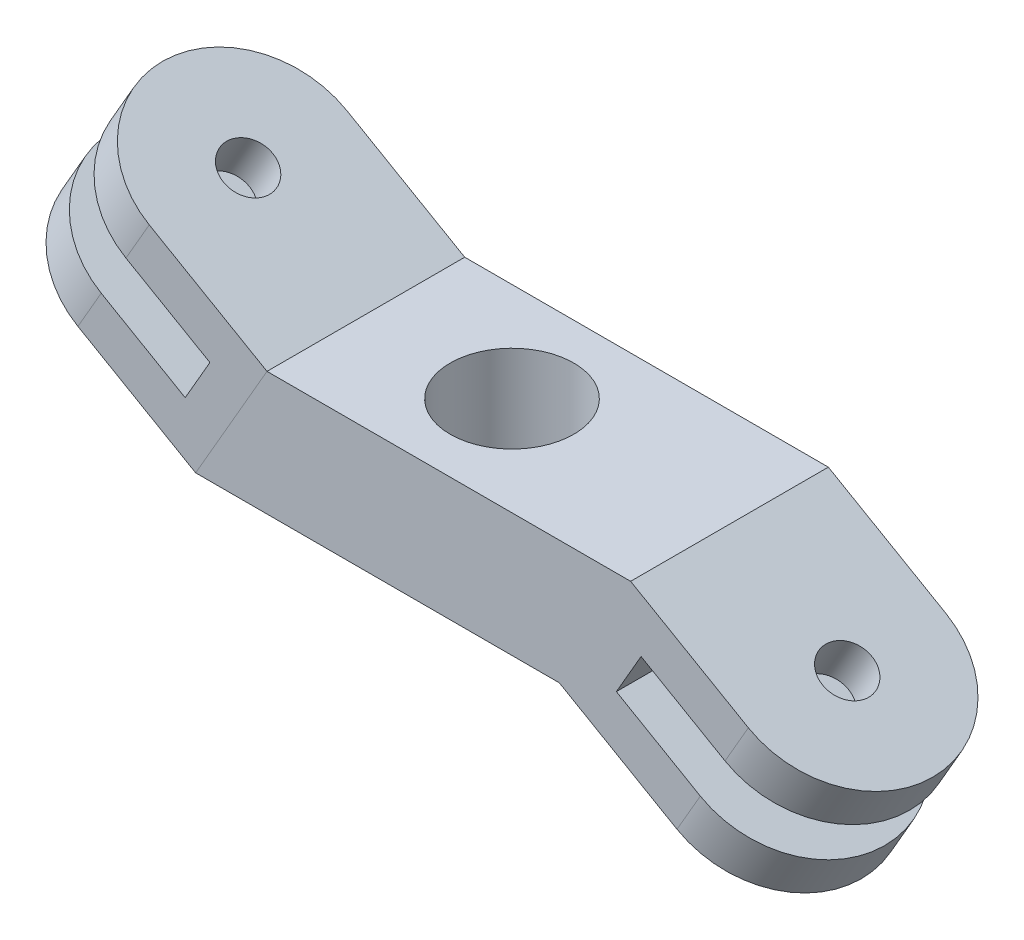
ISO-10303-21;
HEADER;
FILE_DESCRIPTION(('STEP AP214'),'2;1');
FILE_NAME('part.step','',(''),(''),'','','');
FILE_SCHEMA(('AUTOMOTIVE_DESIGN { 1 0 10303 214 1 1 1 1 }'));
ENDSEC;
DATA;
#1=APPLICATION_CONTEXT('core data for automotive mechanical design processes');
#2=APPLICATION_PROTOCOL_DEFINITION('international standard','automotive_design',2000,#1);
#3=PRODUCT_CONTEXT('',#1,'mechanical');
#4=PRODUCT('Part','Part','',(#3));
#5=PRODUCT_RELATED_PRODUCT_CATEGORY('part','',(#4));
#6=PRODUCT_DEFINITION_FORMATION('','',#4);
#7=PRODUCT_DEFINITION_CONTEXT('part definition',#1,'design');
#8=PRODUCT_DEFINITION('design','',#6,#7);
#9=PRODUCT_DEFINITION_SHAPE('','',#8);
#10=(LENGTH_UNIT() NAMED_UNIT(*) SI_UNIT(.MILLI.,.METRE.));
#11=(NAMED_UNIT(*) PLANE_ANGLE_UNIT() SI_UNIT($,.RADIAN.));
#12=(NAMED_UNIT(*) SI_UNIT($,.STERADIAN.) SOLID_ANGLE_UNIT());
#13=UNCERTAINTY_MEASURE_WITH_UNIT(LENGTH_MEASURE(1.E-05),#10,'distance_accuracy_value','');
#14=(GEOMETRIC_REPRESENTATION_CONTEXT(3) GLOBAL_UNCERTAINTY_ASSIGNED_CONTEXT((#13)) GLOBAL_UNIT_ASSIGNED_CONTEXT((#10,
#11,#12)) REPRESENTATION_CONTEXT('',''));
#15=CARTESIAN_POINT('',(0.,0.,0.));
#16=DIRECTION('',(0.,0.,1.));
#17=DIRECTION('',(1.,0.,0.));
#18=AXIS2_PLACEMENT_3D('',#15,#16,#17);
#19=CARTESIAN_POINT('',(-13.5634569427296,2.75040954163251,0.));
#20=DIRECTION('',(0.499999999999998,0.86602540378444,0.));
#21=DIRECTION('',(-0.86602540378444,0.499999999999998,0.));
#22=AXIS2_PLACEMENT_3D('',#19,#20,#21);
#23=CYLINDRICAL_SURFACE('',#22,4.);
#24=DIRECTION('',(0.499999999999998,0.86602540378444,0.));
#25=VECTOR('',#24,1.);
#26=CARTESIAN_POINT('',(-13.5634569427296,2.75040954163251,-4.));
#27=LINE('',#26,#25);
#28=CARTESIAN_POINT('',(-11.6200812697556,6.11643494541695,-4.));
#29=VERTEX_POINT('',#28);
#30=CARTESIAN_POINT('',(-10.6767055967815,7.75040954163251,-4.));
#31=VERTEX_POINT('',#30);
#32=EDGE_CURVE('E88',#29,#31,#27,.T.);
#33=ORIENTED_EDGE('',*,*,#32,.F.);
#34=CARTESIAN_POINT('',(-11.6200812697556,6.11643494541695,0.));
#35=DIRECTION('',(-0.499999999999998,-0.86602540378444,0.));
#36=DIRECTION('',(0.86602540378444,-0.499999999999998,0.));
#37=AXIS2_PLACEMENT_3D('',#34,#35,#36);
#38=CIRCLE('',#37,4.);
#39=CARTESIAN_POINT('',(-11.6200812697556,6.11643494541695,4.));
#40=VERTEX_POINT('',#39);
#41=EDGE_CURVE('E141',#29,#40,#38,.F.);
#42=ORIENTED_EDGE('',*,*,#41,.T.);
#43=DIRECTION('',(0.499999999999998,0.86602540378444,0.));
#44=VECTOR('',#43,1.);
#45=CARTESIAN_POINT('',(-13.5634569427296,2.75040954163251,4.));
#46=LINE('',#45,#44);
#47=CARTESIAN_POINT('',(-10.6767055967815,7.75040954163251,4.));
#48=VERTEX_POINT('',#47);
#49=EDGE_CURVE('E138',#40,#48,#46,.T.);
#50=ORIENTED_EDGE('',*,*,#49,.T.);
#51=CARTESIAN_POINT('',(-10.6767055967815,7.75040954163251,0.));
#52=DIRECTION('',(0.499999999999998,0.86602540378444,0.));
#53=DIRECTION('',(0.86602540378444,-0.499999999999998,0.));
#54=AXIS2_PLACEMENT_3D('',#51,#52,#53);
#55=CIRCLE('',#54,4.);
#56=EDGE_CURVE('E159',#31,#48,#55,.T.);
#57=ORIENTED_EDGE('',*,*,#56,.F.);
#58=EDGE_LOOP('',(#33,#42,#50,#57));
#59=FACE_BOUND('',#58,.T.);
#60=ADVANCED_FACE('F43',(#59),#23,.T.);
#61=CARTESIAN_POINT('',(-13.5634569427296,2.75040954163251,-4.));
#62=DIRECTION('',(0.,0.,-1.));
#63=DIRECTION('',(-1.,0.,0.));
#64=AXIS2_PLACEMENT_3D('',#61,#62,#63);
#65=PLANE('',#64);
#66=DIRECTION('',(0.499999999999998,0.86602540378444,0.));
#67=VECTOR('',#66,1.);
#68=CARTESIAN_POINT('',(-10.1661349398034,0.788964768719224,-4.));
#69=LINE('',#68,#67);
#70=CARTESIAN_POINT('',(-9.22275926682937,2.42293936493478,-4.));
#71=VERTEX_POINT('',#70);
#72=CARTESIAN_POINT('',(-8.22275926682937,4.15499017250366,-4.));
#73=VERTEX_POINT('',#72);
#74=EDGE_CURVE('E130',#71,#73,#69,.T.);
#75=ORIENTED_EDGE('',*,*,#74,.T.);
#76=DIRECTION('',(-0.86602540378444,0.499999999999998,0.));
#77=VECTOR('',#76,1.);
#78=CARTESIAN_POINT('',(-11.6200812697556,6.11643494541695,-4.));
#79=LINE('',#78,#77);
#80=EDGE_CURVE('E144',#73,#29,#79,.T.);
#81=ORIENTED_EDGE('',*,*,#80,.T.);
#82=ORIENTED_EDGE('',*,*,#32,.T.);
#83=DIRECTION('',(-0.86602540378444,0.499999999999998,0.));
#84=VECTOR('',#83,1.);
#85=CARTESIAN_POINT('',(-10.6767055967815,7.75040954163251,-4.));
#86=LINE('',#85,#84);
#87=CARTESIAN_POINT('',(-5.91285652905178,5.,-4.));
#88=VERTEX_POINT('',#87);
#89=EDGE_CURVE('E163',#88,#31,#86,.T.);
#90=ORIENTED_EDGE('',*,*,#89,.F.);
#91=DIRECTION('',(0.499999999999998,0.86602540378444,0.));
#92=VECTOR('',#91,1.);
#93=CARTESIAN_POINT('',(-8.79960787499989,0.,-4.));
#94=LINE('',#93,#92);
#95=CARTESIAN_POINT('',(-8.79960787499989,0.,-4.));
#96=VERTEX_POINT('',#95);
#97=EDGE_CURVE('E182',#96,#88,#94,.T.);
#98=ORIENTED_EDGE('',*,*,#97,.F.);
#99=DIRECTION('',(-0.86602540378444,0.499999999999998,0.));
#100=VECTOR('',#99,1.);
#101=CARTESIAN_POINT('',(-13.5634569427296,2.75040954163251,-4.));
#102=LINE('',#101,#100);
#103=CARTESIAN_POINT('',(-13.5634569427296,2.75040954163251,-4.));
#104=VERTEX_POINT('',#103);
#105=EDGE_CURVE('E168',#96,#104,#102,.T.);
#106=ORIENTED_EDGE('',*,*,#105,.T.);
#107=CARTESIAN_POINT('',(-12.6200812697556,4.38438413784807,-4.));
#108=VERTEX_POINT('',#107);
#109=EDGE_CURVE('E51',#104,#108,#27,.T.);
#110=ORIENTED_EDGE('',*,*,#109,.T.);
#111=DIRECTION('',(-0.86602540378444,0.499999999999998,0.));
#112=VECTOR('',#111,1.);
#113=CARTESIAN_POINT('',(-12.6200812697556,4.38438413784807,-4.));
#114=LINE('',#113,#112);
#115=EDGE_CURVE('E147',#71,#108,#114,.T.);
#116=ORIENTED_EDGE('',*,*,#115,.F.);
#117=EDGE_LOOP('',(#75,#81,#82,#90,#98,#106,#110,#116));
#118=FACE_BOUND('',#117,.T.);
#119=ADVANCED_FACE('F191',(#118),#65,.T.);
#120=CARTESIAN_POINT('',(-13.5634569427296,2.75040954163251,4.));
#121=DIRECTION('',(0.,0.,1.));
#122=DIRECTION('',(1.,0.,0.));
#123=AXIS2_PLACEMENT_3D('',#120,#121,#122);
#124=PLANE('',#123);
#125=ORIENTED_EDGE('',*,*,#49,.F.);
#126=DIRECTION('',(0.86602540378444,-0.499999999999998,0.));
#127=VECTOR('',#126,1.);
#128=CARTESIAN_POINT('',(-11.6200812697556,6.11643494541695,4.));
#129=LINE('',#128,#127);
#130=CARTESIAN_POINT('',(-8.22275926682937,4.15499017250366,4.));
#131=VERTEX_POINT('',#130);
#132=EDGE_CURVE('E136',#40,#131,#129,.T.);
#133=ORIENTED_EDGE('',*,*,#132,.T.);
#134=DIRECTION('',(-0.499999999999998,-0.86602540378444,0.));
#135=VECTOR('',#134,1.);
#136=CARTESIAN_POINT('',(-10.1661349398034,0.788964768719224,4.));
#137=LINE('',#136,#135);
#138=CARTESIAN_POINT('',(-9.22275926682937,2.42293936493478,4.));
#139=VERTEX_POINT('',#138);
#140=EDGE_CURVE('E12',#131,#139,#137,.T.);
#141=ORIENTED_EDGE('',*,*,#140,.T.);
#142=DIRECTION('',(0.86602540378444,-0.499999999999998,0.));
#143=VECTOR('',#142,1.);
#144=CARTESIAN_POINT('',(-12.6200812697556,4.38438413784807,4.));
#145=LINE('',#144,#143);
#146=CARTESIAN_POINT('',(-12.6200812697556,4.38438413784807,4.));
#147=VERTEX_POINT('',#146);
#148=EDGE_CURVE('E117',#147,#139,#145,.T.);
#149=ORIENTED_EDGE('',*,*,#148,.F.);
#150=CARTESIAN_POINT('',(-13.5634569427296,2.75040954163251,4.));
#151=VERTEX_POINT('',#150);
#152=EDGE_CURVE('E95',#151,#147,#46,.T.);
#153=ORIENTED_EDGE('',*,*,#152,.F.);
#154=DIRECTION('',(0.86602540378444,-0.499999999999998,0.));
#155=VECTOR('',#154,1.);
#156=CARTESIAN_POINT('',(-13.5634569427296,2.75040954163251,4.));
#157=LINE('',#156,#155);
#158=CARTESIAN_POINT('',(-8.79960787499989,0.,4.));
#159=VERTEX_POINT('',#158);
#160=EDGE_CURVE('E162',#151,#159,#157,.T.);
#161=ORIENTED_EDGE('',*,*,#160,.T.);
#162=DIRECTION('',(0.499999999999998,0.86602540378444,0.));
#163=VECTOR('',#162,1.);
#164=CARTESIAN_POINT('',(-8.79960787499989,0.,4.));
#165=LINE('',#164,#163);
#166=CARTESIAN_POINT('',(-5.91285652905178,5.,4.));
#167=VERTEX_POINT('',#166);
#168=EDGE_CURVE('E184',#159,#167,#165,.T.);
#169=ORIENTED_EDGE('',*,*,#168,.T.);
#170=DIRECTION('',(0.86602540378444,-0.499999999999998,0.));
#171=VECTOR('',#170,1.);
#172=CARTESIAN_POINT('',(-10.6767055967815,7.75040954163251,4.));
#173=LINE('',#172,#171);
#174=EDGE_CURVE('E173',#48,#167,#173,.T.);
#175=ORIENTED_EDGE('',*,*,#174,.F.);
#176=EDGE_LOOP('',(#125,#133,#141,#149,#153,#161,#169,#175));
#177=FACE_BOUND('',#176,.T.);
#178=ADVANCED_FACE('F135',(#177),#124,.T.);
#179=CARTESIAN_POINT('',(-14.9776705051027,0.300919798849321,0.));
#180=DIRECTION('',(0.499999999999998,0.86602540378444,0.));
#181=DIRECTION('',(-0.86602540378444,0.499999999999998,0.));
#182=AXIS2_PLACEMENT_3D('',#179,#180,#181);
#183=CYLINDRICAL_SURFACE('',#182,1.);
#184=CARTESIAN_POINT('',(-10.6767055967815,7.75040954163251,0.));
#185=DIRECTION('',(0.499999999999998,0.86602540378444,0.));
#186=DIRECTION('',(-0.86602540378444,0.499999999999998,0.));
#187=AXIS2_PLACEMENT_3D('',#184,#185,#186);
#188=CIRCLE('',#187,1.);
#189=CARTESIAN_POINT('',(-11.542731000566,8.25040954163251,0.));
#190=VERTEX_POINT('',#189);
#191=EDGE_CURVE('E153',#190,#190,#188,.T.);
#192=ORIENTED_EDGE('',*,*,#191,.T.);
#193=EDGE_LOOP('',(#192));
#194=FACE_BOUND('',#193,.T.);
#195=CARTESIAN_POINT('',(-11.6200812697556,6.11643494541695,0.));
#196=DIRECTION('',(-0.499999999999998,-0.86602540378444,0.));
#197=DIRECTION('',(0.86602540378444,-0.499999999999998,0.));
#198=AXIS2_PLACEMENT_3D('',#195,#196,#197);
#199=CIRCLE('',#198,1.);
#200=CARTESIAN_POINT('',(-10.7540558659712,5.61643494541695,0.));
#201=VERTEX_POINT('',#200);
#202=EDGE_CURVE('E142',#201,#201,#199,.F.);
#203=ORIENTED_EDGE('',*,*,#202,.F.);
#204=EDGE_LOOP('',(#203));
#205=FACE_BOUND('',#204,.T.);
#206=ADVANCED_FACE('F209',(#194,#205),#183,.F.);
#207=CARTESIAN_POINT('',(-12.6200812697556,4.38438413784807,0.));
#208=DIRECTION('',(-0.499999999999998,-0.86602540378444,0.));
#209=DIRECTION('',(0.86602540378444,-0.499999999999998,0.));
#210=AXIS2_PLACEMENT_3D('',#207,#208,#209);
#211=CIRCLE('',#210,4.);
#212=EDGE_CURVE('E58',#108,#147,#211,.F.);
#213=ORIENTED_EDGE('',*,*,#212,.F.);
#214=ORIENTED_EDGE('',*,*,#109,.F.);
#215=CARTESIAN_POINT('',(-13.5634569427296,2.75040954163251,0.));
#216=DIRECTION('',(0.499999999999998,0.86602540378444,0.));
#217=DIRECTION('',(0.86602540378444,-0.499999999999998,0.));
#218=AXIS2_PLACEMENT_3D('',#215,#216,#217);
#219=CIRCLE('',#218,4.);
#220=EDGE_CURVE('E160',#104,#151,#219,.T.);
#221=ORIENTED_EDGE('',*,*,#220,.T.);
#222=ORIENTED_EDGE('',*,*,#152,.T.);
#223=EDGE_LOOP('',(#213,#214,#221,#222));
#224=FACE_BOUND('',#223,.T.);
#225=ADVANCED_FACE('F45',(#224),#23,.T.);
#226=CARTESIAN_POINT('',(-8.79960787499989,0.,4.));
#227=DIRECTION('',(0.86602540378444,-0.499999999999998,0.));
#228=DIRECTION('',(0.499999999999998,0.86602540378444,0.));
#229=AXIS2_PLACEMENT_3D('',#226,#227,#228);
#230=PLANE('',#229);
#231=DIRECTION('',(0.,0.,-1.));
#232=VECTOR('',#231,1.);
#233=CARTESIAN_POINT('',(-5.91285652905178,5.,4.));
#234=LINE('',#233,#232);
#235=EDGE_CURVE('E176',#167,#88,#234,.T.);
#236=ORIENTED_EDGE('',*,*,#235,.F.);
#237=ORIENTED_EDGE('',*,*,#168,.F.);
#238=DIRECTION('',(0.,0.,-1.));
#239=VECTOR('',#238,1.);
#240=CARTESIAN_POINT('',(-8.79960787499989,0.,4.));
#241=LINE('',#240,#239);
#242=EDGE_CURVE('E165',#159,#96,#241,.T.);
#243=ORIENTED_EDGE('',*,*,#242,.T.);
#244=ORIENTED_EDGE('',*,*,#97,.T.);
#245=EDGE_LOOP('',(#236,#237,#243,#244));
#246=FACE_BOUND('',#245,.T.);
#247=ADVANCED_FACE('F198',(#246),#230,.T.);
#248=CARTESIAN_POINT('',(-13.5634569427296,2.75040954163251,0.));
#249=DIRECTION('',(-0.499999999999998,-0.86602540378444,0.));
#250=DIRECTION('',(0.86602540378444,-0.499999999999998,0.));
#251=AXIS2_PLACEMENT_3D('',#248,#249,#250);
#252=PLANE('',#251);
#253=CARTESIAN_POINT('',(-13.5634569427296,2.75040954163251,0.));
#254=DIRECTION('',(-0.499999999999998,-0.86602540378444,0.));
#255=DIRECTION('',(0.86602540378444,-0.499999999999998,0.));
#256=AXIS2_PLACEMENT_3D('',#253,#254,#255);
#257=CIRCLE('',#256,1.);
#258=CARTESIAN_POINT('',(-12.6974315389452,2.25040954163251,0.));
#259=VERTEX_POINT('',#258);
#260=EDGE_CURVE('E156',#259,#259,#257,.F.);
#261=ORIENTED_EDGE('',*,*,#260,.T.);
#262=EDGE_LOOP('',(#261));
#263=FACE_BOUND('',#262,.T.);
#264=ORIENTED_EDGE('',*,*,#220,.F.);
#265=ORIENTED_EDGE('',*,*,#105,.F.);
#266=ORIENTED_EDGE('',*,*,#242,.F.);
#267=ORIENTED_EDGE('',*,*,#160,.F.);
#268=EDGE_LOOP('',(#264,#265,#266,#267));
#269=FACE_BOUND('',#268,.T.);
#270=ADVANCED_FACE('F195',(#263,#269),#252,.T.);
#271=CARTESIAN_POINT('',(-10.6767055967815,7.75040954163251,0.));
#272=DIRECTION('',(-0.499999999999998,-0.86602540378444,0.));
#273=DIRECTION('',(0.86602540378444,-0.499999999999998,0.));
#274=AXIS2_PLACEMENT_3D('',#271,#272,#273);
#275=PLANE('',#274);
#276=ORIENTED_EDGE('',*,*,#191,.F.);
#277=EDGE_LOOP('',(#276));
#278=FACE_BOUND('',#277,.T.);
#279=ORIENTED_EDGE('',*,*,#56,.T.);
#280=ORIENTED_EDGE('',*,*,#174,.T.);
#281=ORIENTED_EDGE('',*,*,#235,.T.);
#282=ORIENTED_EDGE('',*,*,#89,.T.);
#283=EDGE_LOOP('',(#279,#280,#281,#282));
#284=FACE_BOUND('',#283,.T.);
#285=ADVANCED_FACE('F200',(#278,#284),#275,.F.);
#286=CARTESIAN_POINT('',(-12.6200812697556,4.38438413784807,0.));
#287=DIRECTION('',(-0.499999999999998,-0.86602540378444,0.));
#288=DIRECTION('',(0.86602540378444,-0.499999999999998,0.));
#289=AXIS2_PLACEMENT_3D('',#286,#287,#288);
#290=CIRCLE('',#289,1.);
#291=CARTESIAN_POINT('',(-11.7540558659711,3.88438413784807,0.));
#292=VERTEX_POINT('',#291);
#293=EDGE_CURVE('E123',#292,#292,#290,.F.);
#294=ORIENTED_EDGE('',*,*,#293,.T.);
#295=EDGE_LOOP('',(#294));
#296=FACE_BOUND('',#295,.T.);
#297=ORIENTED_EDGE('',*,*,#260,.F.);
#298=EDGE_LOOP('',(#297));
#299=FACE_BOUND('',#298,.T.);
#300=ADVANCED_FACE('F205',(#296,#299),#183,.F.);
#301=CARTESIAN_POINT('',(-0.256526295775901,-0.444316577761305,0.));
#302=DIRECTION('',(-0.499999999999998,-0.86602540378444,0.));
#303=DIRECTION('',(0.86602540378444,-0.499999999999998,0.));
#304=AXIS2_PLACEMENT_3D('',#301,#302,#303);
#305=PLANE('',#304);
#306=DIRECTION('',(0.,0.,-1.));
#307=VECTOR('',#306,1.);
#308=CARTESIAN_POINT('',(-8.22275926682937,4.15499017250366,-8.29704242386596));
#309=LINE('',#308,#307);
#310=EDGE_CURVE('E131',#131,#73,#309,.T.);
#311=ORIENTED_EDGE('',*,*,#310,.F.);
#312=ORIENTED_EDGE('',*,*,#132,.F.);
#313=ORIENTED_EDGE('',*,*,#41,.F.);
#314=ORIENTED_EDGE('',*,*,#80,.F.);
#315=EDGE_LOOP('',(#311,#312,#313,#314));
#316=FACE_BOUND('',#315,.T.);
#317=ORIENTED_EDGE('',*,*,#202,.T.);
#318=EDGE_LOOP('',(#317));
#319=FACE_BOUND('',#318,.T.);
#320=ADVANCED_FACE('F202',(#316,#319),#305,.T.);
#321=CARTESIAN_POINT('',(-1.2565262957759,-2.17636738533018,0.));
#322=DIRECTION('',(-0.499999999999998,-0.86602540378444,0.));
#323=DIRECTION('',(0.86602540378444,-0.499999999999998,0.));
#324=AXIS2_PLACEMENT_3D('',#321,#322,#323);
#325=PLANE('',#324);
#326=ORIENTED_EDGE('',*,*,#115,.T.);
#327=ORIENTED_EDGE('',*,*,#212,.T.);
#328=ORIENTED_EDGE('',*,*,#148,.T.);
#329=DIRECTION('',(0.,0.,-1.));
#330=VECTOR('',#329,1.);
#331=CARTESIAN_POINT('',(-9.22275926682937,2.42293936493478,-8.29704242386596));
#332=LINE('',#331,#330);
#333=EDGE_CURVE('E121',#139,#71,#332,.T.);
#334=ORIENTED_EDGE('',*,*,#333,.T.);
#335=EDGE_LOOP('',(#326,#327,#328,#334));
#336=FACE_BOUND('',#335,.T.);
#337=ORIENTED_EDGE('',*,*,#293,.F.);
#338=EDGE_LOOP('',(#337));
#339=FACE_BOUND('',#338,.T.);
#340=ADVANCED_FACE('F119',(#336,#339),#325,.F.);
#341=CARTESIAN_POINT('',(-8.22275926682937,4.15499017250366,-8.29704242386596));
#342=DIRECTION('',(-0.86602540378444,0.499999999999998,0.));
#343=DIRECTION('',(-0.499999999999998,-0.86602540378444,0.));
#344=AXIS2_PLACEMENT_3D('',#341,#342,#343);
#345=PLANE('',#344);
#346=ORIENTED_EDGE('',*,*,#333,.F.);
#347=ORIENTED_EDGE('',*,*,#140,.F.);
#348=ORIENTED_EDGE('',*,*,#310,.T.);
#349=ORIENTED_EDGE('',*,*,#74,.F.);
#350=EDGE_LOOP('',(#346,#347,#348,#349));
#351=FACE_BOUND('',#350,.T.);
#352=ADVANCED_FACE('F126',(#351),#345,.T.);
#353=CLOSED_SHELL('',(#60,#119,#178,#206,#225,#247,#270,#285,#300,#320,#340,#352));
#354=MANIFOLD_SOLID_BREP('B2',#353);
#355=CARTESIAN_POINT('',(0.,0.,0.));
#356=DIRECTION('',(0.,1.,0.));
#357=DIRECTION('',(0.,0.,1.));
#358=AXIS2_PLACEMENT_3D('',#355,#356,#357);
#359=PLANE('',#358);
#360=CARTESIAN_POINT('',(0.,0.,0.));
#361=DIRECTION('',(0.,1.,0.));
#362=DIRECTION('',(0.,0.,1.));
#363=AXIS2_PLACEMENT_3D('',#360,#361,#362);
#364=CIRCLE('',#363,2.5);
#365=CARTESIAN_POINT('',(0.,0.,2.5));
#366=VERTEX_POINT('',#365);
#367=EDGE_CURVE('E41',#366,#366,#364,.F.);
#368=ORIENTED_EDGE('',*,*,#367,.F.);
#369=EDGE_LOOP('',(#368));
#370=FACE_BOUND('',#369,.T.);
#371=DIRECTION('',(0.,0.,-1.));
#372=VECTOR('',#371,1.);
#373=CARTESIAN_POINT('',(5.91285652905178,0.,0.));
#374=LINE('',#373,#372);
#375=CARTESIAN_POINT('',(5.91285652905178,0.,4.));
#376=VERTEX_POINT('',#375);
#377=CARTESIAN_POINT('',(5.91285652905178,0.,-4.));
#378=VERTEX_POINT('',#377);
#379=EDGE_CURVE('E457',#376,#378,#374,.T.);
#380=ORIENTED_EDGE('',*,*,#379,.F.);
#381=DIRECTION('',(1.,0.,0.));
#382=VECTOR('',#381,1.);
#383=CARTESIAN_POINT('',(-3.07009589621998,0.,4.));
#384=LINE('',#383,#382);
#385=CARTESIAN_POINT('',(-8.79960787499989,0.,4.));
#386=VERTEX_POINT('',#385);
#387=EDGE_CURVE('E470',#386,#376,#384,.T.);
#388=ORIENTED_EDGE('',*,*,#387,.F.);
#389=DIRECTION('',(0.,0.,1.));
#390=VECTOR('',#389,1.);
#391=CARTESIAN_POINT('',(-8.79960787499989,0.,-4.));
#392=LINE('',#391,#390);
#393=CARTESIAN_POINT('',(-8.79960787499989,0.,-4.));
#394=VERTEX_POINT('',#393);
#395=EDGE_CURVE('E477',#394,#386,#392,.T.);
#396=ORIENTED_EDGE('',*,*,#395,.F.);
#397=DIRECTION('',(1.,0.,0.));
#398=VECTOR('',#397,1.);
#399=CARTESIAN_POINT('',(-3.07009589621998,0.,-4.));
#400=LINE('',#399,#398);
#401=EDGE_CURVE('E475',#394,#378,#400,.T.);
#402=ORIENTED_EDGE('',*,*,#401,.T.);
#403=EDGE_LOOP('',(#380,#388,#396,#402));
#404=FACE_BOUND('',#403,.T.);
#405=ADVANCED_FACE('F309',(#370,#404),#359,.F.);
#406=CARTESIAN_POINT('',(0.,5.,0.));
#407=DIRECTION('',(0.,1.,0.));
#408=DIRECTION('',(0.,0.,1.));
#409=AXIS2_PLACEMENT_3D('',#406,#407,#408);
#410=PLANE('',#409);
#411=DIRECTION('',(-1.,0.,0.));
#412=VECTOR('',#411,1.);
#413=CARTESIAN_POINT('',(-3.07009589621998,5.,4.));
#414=LINE('',#413,#412);
#415=CARTESIAN_POINT('',(8.79960787499989,5.,4.));
#416=VERTEX_POINT('',#415);
#417=CARTESIAN_POINT('',(-5.91285652905178,5.,4.));
#418=VERTEX_POINT('',#417);
#419=EDGE_CURVE('E468',#416,#418,#414,.T.);
#420=ORIENTED_EDGE('',*,*,#419,.F.);
#421=DIRECTION('',(0.,0.,1.));
#422=VECTOR('',#421,1.);
#423=CARTESIAN_POINT('',(8.79960787499989,5.,-4.));
#424=LINE('',#423,#422);
#425=CARTESIAN_POINT('',(8.79960787499989,5.,-4.));
#426=VERTEX_POINT('',#425);
#427=EDGE_CURVE('E460',#426,#416,#424,.T.);
#428=ORIENTED_EDGE('',*,*,#427,.F.);
#429=DIRECTION('',(-1.,0.,0.));
#430=VECTOR('',#429,1.);
#431=CARTESIAN_POINT('',(-3.07009589621998,5.,-4.));
#432=LINE('',#431,#430);
#433=CARTESIAN_POINT('',(-5.91285652905178,5.,-4.));
#434=VERTEX_POINT('',#433);
#435=EDGE_CURVE('E472',#426,#434,#432,.T.);
#436=ORIENTED_EDGE('',*,*,#435,.T.);
#437=DIRECTION('',(0.,0.,1.));
#438=VECTOR('',#437,1.);
#439=CARTESIAN_POINT('',(-5.91285652905178,5.,0.));
#440=LINE('',#439,#438);
#441=EDGE_CURVE('E328',#434,#418,#440,.T.);
#442=ORIENTED_EDGE('',*,*,#441,.T.);
#443=EDGE_LOOP('',(#420,#428,#436,#442));
#444=FACE_BOUND('',#443,.T.);
#445=CARTESIAN_POINT('',(0.,5.,0.));
#446=DIRECTION('',(0.,1.,0.));
#447=DIRECTION('',(0.,0.,1.));
#448=AXIS2_PLACEMENT_3D('',#445,#446,#447);
#449=CIRCLE('',#448,2.5);
#450=CARTESIAN_POINT('',(0.,5.,2.5));
#451=VERTEX_POINT('',#450);
#452=EDGE_CURVE('E316',#451,#451,#449,.T.);
#453=ORIENTED_EDGE('',*,*,#452,.F.);
#454=EDGE_LOOP('',(#453));
#455=FACE_BOUND('',#454,.T.);
#456=ADVANCED_FACE('F483',(#444,#455),#410,.T.);
#457=CARTESIAN_POINT('',(0.,0.,-4.));
#458=DIRECTION('',(0.,0.,1.));
#459=DIRECTION('',(1.,0.,0.));
#460=AXIS2_PLACEMENT_3D('',#457,#458,#459);
#461=PLANE('',#460);
#462=DIRECTION('',(-0.499999999999998,-0.86602540378444,0.));
#463=VECTOR('',#462,1.);
#464=CARTESIAN_POINT('',(-6.59970590624994,3.81034198154574,-4.));
#465=LINE('',#464,#463);
#466=EDGE_CURVE('E323',#434,#394,#465,.T.);
#467=ORIENTED_EDGE('',*,*,#466,.F.);
#468=ORIENTED_EDGE('',*,*,#435,.F.);
#469=DIRECTION('',(0.86602540378444,-0.499999999999998,0.));
#470=VECTOR('',#469,1.);
#471=CARTESIAN_POINT('',(13.5634569427296,2.24959045836749,-4.));
#472=LINE('',#471,#470);
#473=CARTESIAN_POINT('',(13.5634569427296,2.24959045836749,-4.));
#474=VERTEX_POINT('',#473);
#475=EDGE_CURVE('E412',#426,#474,#472,.T.);
#476=ORIENTED_EDGE('',*,*,#475,.T.);
#477=DIRECTION('',(-0.499999999999998,-0.86602540378444,0.));
#478=VECTOR('',#477,1.);
#479=CARTESIAN_POINT('',(13.5634569427296,2.24959045836749,-4.));
#480=LINE('',#479,#478);
#481=CARTESIAN_POINT('',(12.6200812697556,0.615615862151931,-4.));
#482=VERTEX_POINT('',#481);
#483=EDGE_CURVE('E395',#474,#482,#480,.T.);
#484=ORIENTED_EDGE('',*,*,#483,.T.);
#485=DIRECTION('',(0.86602540378444,-0.499999999999998,0.));
#486=VECTOR('',#485,1.);
#487=CARTESIAN_POINT('',(12.6200812697556,0.615615862151931,-4.));
#488=LINE('',#487,#486);
#489=CARTESIAN_POINT('',(9.22275926682937,2.57706063506522,-4.));
#490=VERTEX_POINT('',#489);
#491=EDGE_CURVE('E418',#490,#482,#488,.T.);
#492=ORIENTED_EDGE('',*,*,#491,.F.);
#493=DIRECTION('',(-0.499999999999998,-0.86602540378444,0.));
#494=VECTOR('',#493,1.);
#495=CARTESIAN_POINT('',(10.1661349398034,4.21103523128078,-4.));
#496=LINE('',#495,#494);
#497=CARTESIAN_POINT('',(8.22275926682937,0.845009827496336,-4.));
#498=VERTEX_POINT('',#497);
#499=EDGE_CURVE('E409',#490,#498,#496,.T.);
#500=ORIENTED_EDGE('',*,*,#499,.T.);
#501=DIRECTION('',(0.86602540378444,-0.499999999999998,0.));
#502=VECTOR('',#501,1.);
#503=CARTESIAN_POINT('',(11.6200812697556,-1.11643494541695,-4.));
#504=LINE('',#503,#502);
#505=CARTESIAN_POINT('',(11.6200812697556,-1.11643494541695,-4.));
#506=VERTEX_POINT('',#505);
#507=EDGE_CURVE('E402',#498,#506,#504,.T.);
#508=ORIENTED_EDGE('',*,*,#507,.T.);
#509=CARTESIAN_POINT('',(10.6767055967815,-2.75040954163251,-4.));
#510=VERTEX_POINT('',#509);
#511=EDGE_CURVE('E383',#506,#510,#480,.T.);
#512=ORIENTED_EDGE('',*,*,#511,.T.);
#513=DIRECTION('',(0.86602540378444,-0.499999999999998,0.));
#514=VECTOR('',#513,1.);
#515=CARTESIAN_POINT('',(10.6767055967815,-2.75040954163251,-4.));
#516=LINE('',#515,#514);
#517=EDGE_CURVE('E410',#378,#510,#516,.T.);
#518=ORIENTED_EDGE('',*,*,#517,.F.);
#519=ORIENTED_EDGE('',*,*,#401,.F.);
#520=EDGE_LOOP('',(#467,#468,#476,#484,#492,#500,#508,#512,#518,#519));
#521=FACE_BOUND('',#520,.T.);
#522=ADVANCED_FACE('F407',(#521),#461,.F.);
#523=CARTESIAN_POINT('',(0.,0.,4.));
#524=DIRECTION('',(0.,0.,1.));
#525=DIRECTION('',(1.,0.,0.));
#526=AXIS2_PLACEMENT_3D('',#523,#524,#525);
#527=PLANE('',#526);
#528=ORIENTED_EDGE('',*,*,#387,.T.);
#529=DIRECTION('',(-0.86602540378444,0.499999999999998,0.));
#530=VECTOR('',#529,1.);
#531=CARTESIAN_POINT('',(10.6767055967815,-2.75040954163251,4.));
#532=LINE('',#531,#530);
#533=CARTESIAN_POINT('',(10.6767055967815,-2.75040954163251,4.));
#534=VERTEX_POINT('',#533);
#535=EDGE_CURVE('E431',#534,#376,#532,.T.);
#536=ORIENTED_EDGE('',*,*,#535,.F.);
#537=DIRECTION('',(-0.499999999999998,-0.86602540378444,0.));
#538=VECTOR('',#537,1.);
#539=CARTESIAN_POINT('',(13.5634569427296,2.24959045836749,4.));
#540=LINE('',#539,#538);
#541=CARTESIAN_POINT('',(11.6200812697556,-1.11643494541695,4.));
#542=VERTEX_POINT('',#541);
#543=EDGE_CURVE('E405',#542,#534,#540,.T.);
#544=ORIENTED_EDGE('',*,*,#543,.F.);
#545=DIRECTION('',(-0.86602540378444,0.499999999999998,0.));
#546=VECTOR('',#545,1.);
#547=CARTESIAN_POINT('',(11.6200812697556,-1.11643494541695,4.));
#548=LINE('',#547,#546);
#549=CARTESIAN_POINT('',(8.22275926682937,0.845009827496336,4.));
#550=VERTEX_POINT('',#549);
#551=EDGE_CURVE('E404',#542,#550,#548,.T.);
#552=ORIENTED_EDGE('',*,*,#551,.T.);
#553=DIRECTION('',(0.499999999999998,0.86602540378444,0.));
#554=VECTOR('',#553,1.);
#555=CARTESIAN_POINT('',(10.1661349398034,4.21103523128078,4.));
#556=LINE('',#555,#554);
#557=CARTESIAN_POINT('',(9.22275926682937,2.57706063506522,4.));
#558=VERTEX_POINT('',#557);
#559=EDGE_CURVE('E422',#550,#558,#556,.T.);
#560=ORIENTED_EDGE('',*,*,#559,.T.);
#561=DIRECTION('',(-0.86602540378444,0.499999999999998,0.));
#562=VECTOR('',#561,1.);
#563=CARTESIAN_POINT('',(12.6200812697556,0.615615862151931,4.));
#564=LINE('',#563,#562);
#565=CARTESIAN_POINT('',(12.6200812697556,0.615615862151931,4.));
#566=VERTEX_POINT('',#565);
#567=EDGE_CURVE('E424',#566,#558,#564,.T.);
#568=ORIENTED_EDGE('',*,*,#567,.F.);
#569=CARTESIAN_POINT('',(13.5634569427296,2.24959045836749,4.));
#570=VERTEX_POINT('',#569);
#571=EDGE_CURVE('E427',#570,#566,#540,.T.);
#572=ORIENTED_EDGE('',*,*,#571,.F.);
#573=DIRECTION('',(-0.86602540378444,0.499999999999998,0.));
#574=VECTOR('',#573,1.);
#575=CARTESIAN_POINT('',(13.5634569427296,2.24959045836749,4.));
#576=LINE('',#575,#574);
#577=EDGE_CURVE('E428',#570,#416,#576,.T.);
#578=ORIENTED_EDGE('',*,*,#577,.T.);
#579=ORIENTED_EDGE('',*,*,#419,.T.);
#580=DIRECTION('',(-0.499999999999998,-0.86602540378444,0.));
#581=VECTOR('',#580,1.);
#582=CARTESIAN_POINT('',(-6.59970590624994,3.81034198154574,4.));
#583=LINE('',#582,#581);
#584=EDGE_CURVE('E463',#418,#386,#583,.T.);
#585=ORIENTED_EDGE('',*,*,#584,.T.);
#586=EDGE_LOOP('',(#528,#536,#544,#552,#560,#568,#572,#578,#579,#585));
#587=FACE_BOUND('',#586,.T.);
#588=ADVANCED_FACE('F490',(#587),#527,.T.);
#589=CARTESIAN_POINT('',(0.,-7.07106781186548,0.));
#590=DIRECTION('',(0.,1.,0.));
#591=DIRECTION('',(0.,0.,1.));
#592=AXIS2_PLACEMENT_3D('',#589,#590,#591);
#593=CYLINDRICAL_SURFACE('',#592,2.5);
#594=ORIENTED_EDGE('',*,*,#367,.T.);
#595=EDGE_LOOP('',(#594));
#596=FACE_BOUND('',#595,.T.);
#597=ORIENTED_EDGE('',*,*,#452,.T.);
#598=EDGE_LOOP('',(#597));
#599=FACE_BOUND('',#598,.T.);
#600=ADVANCED_FACE('F481',(#596,#599),#593,.F.);
#601=CARTESIAN_POINT('',(-6.59970590624994,3.81034198154574,0.));
#602=DIRECTION('',(-0.86602540378444,0.499999999999998,0.));
#603=DIRECTION('',(-0.499999999999998,-0.86602540378444,0.));
#604=AXIS2_PLACEMENT_3D('',#601,#602,#603);
#605=PLANE('',#604);
#606=ORIENTED_EDGE('',*,*,#466,.T.);
#607=ORIENTED_EDGE('',*,*,#395,.T.);
#608=ORIENTED_EDGE('',*,*,#584,.F.);
#609=ORIENTED_EDGE('',*,*,#441,.F.);
#610=EDGE_LOOP('',(#606,#607,#608,#609));
#611=FACE_BOUND('',#610,.T.);
#612=ADVANCED_FACE('F495',(#611),#605,.T.);
#613=CARTESIAN_POINT('',(13.5634569427296,2.24959045836749,0.));
#614=DIRECTION('',(-0.499999999999998,-0.86602540378444,0.));
#615=DIRECTION('',(0.86602540378444,-0.499999999999998,0.));
#616=AXIS2_PLACEMENT_3D('',#613,#614,#615);
#617=CYLINDRICAL_SURFACE('',#616,4.);
#618=ORIENTED_EDGE('',*,*,#511,.F.);
#619=CARTESIAN_POINT('',(11.6200812697556,-1.11643494541695,0.));
#620=DIRECTION('',(0.499999999999998,0.86602540378444,0.));
#621=DIRECTION('',(-0.86602540378444,0.499999999999998,0.));
#622=AXIS2_PLACEMENT_3D('',#619,#620,#621);
#623=CIRCLE('',#622,4.);
#624=EDGE_CURVE('E386',#506,#542,#623,.F.);
#625=ORIENTED_EDGE('',*,*,#624,.T.);
#626=ORIENTED_EDGE('',*,*,#543,.T.);
#627=CARTESIAN_POINT('',(10.6767055967815,-2.75040954163251,0.));
#628=DIRECTION('',(-0.499999999999998,-0.86602540378444,0.));
#629=DIRECTION('',(-0.86602540378444,0.499999999999998,0.));
#630=AXIS2_PLACEMENT_3D('',#627,#628,#629);
#631=CIRCLE('',#630,4.);
#632=EDGE_CURVE('E389',#510,#534,#631,.T.);
#633=ORIENTED_EDGE('',*,*,#632,.F.);
#634=EDGE_LOOP('',(#618,#625,#626,#633));
#635=FACE_BOUND('',#634,.T.);
#636=ADVANCED_FACE('F385',(#635),#617,.T.);
#637=CARTESIAN_POINT('',(14.9776705051027,4.69908020115068,0.));
#638=DIRECTION('',(-0.499999999999998,-0.86602540378444,0.));
#639=DIRECTION('',(0.86602540378444,-0.499999999999998,0.));
#640=AXIS2_PLACEMENT_3D('',#637,#638,#639);
#641=CYLINDRICAL_SURFACE('',#640,1.);
#642=CARTESIAN_POINT('',(10.6767055967815,-2.75040954163251,0.));
#643=DIRECTION('',(-0.499999999999998,-0.86602540378444,0.));
#644=DIRECTION('',(0.86602540378444,-0.499999999999998,0.));
#645=AXIS2_PLACEMENT_3D('',#642,#643,#644);
#646=CIRCLE('',#645,1.);
#647=CARTESIAN_POINT('',(11.542731000566,-3.25040954163251,0.));
#648=VERTEX_POINT('',#647);
#649=EDGE_CURVE('E434',#648,#648,#646,.T.);
#650=ORIENTED_EDGE('',*,*,#649,.T.);
#651=EDGE_LOOP('',(#650));
#652=FACE_BOUND('',#651,.T.);
#653=CARTESIAN_POINT('',(11.6200812697556,-1.11643494541695,0.));
#654=DIRECTION('',(0.499999999999998,0.86602540378444,0.));
#655=DIRECTION('',(-0.86602540378444,0.499999999999998,0.));
#656=AXIS2_PLACEMENT_3D('',#653,#654,#655);
#657=CIRCLE('',#656,1.);
#658=CARTESIAN_POINT('',(10.7540558659712,-0.616434945416947,0.));
#659=VERTEX_POINT('',#658);
#660=EDGE_CURVE('E437',#659,#659,#657,.F.);
#661=ORIENTED_EDGE('',*,*,#660,.F.);
#662=EDGE_LOOP('',(#661));
#663=FACE_BOUND('',#662,.T.);
#664=ADVANCED_FACE('F523',(#652,#663),#641,.F.);
#665=CARTESIAN_POINT('',(12.6200812697556,0.615615862151931,0.));
#666=DIRECTION('',(0.499999999999998,0.86602540378444,0.));
#667=DIRECTION('',(-0.86602540378444,0.499999999999998,0.));
#668=AXIS2_PLACEMENT_3D('',#665,#666,#667);
#669=CIRCLE('',#668,4.);
#670=EDGE_CURVE('E440',#482,#566,#669,.F.);
#671=ORIENTED_EDGE('',*,*,#670,.F.);
#672=ORIENTED_EDGE('',*,*,#483,.F.);
#673=CARTESIAN_POINT('',(13.5634569427296,2.24959045836749,0.));
#674=DIRECTION('',(-0.499999999999998,-0.86602540378444,0.));
#675=DIRECTION('',(-0.86602540378444,0.499999999999998,0.));
#676=AXIS2_PLACEMENT_3D('',#673,#674,#675);
#677=CIRCLE('',#676,4.);
#678=EDGE_CURVE('E443',#474,#570,#677,.T.);
#679=ORIENTED_EDGE('',*,*,#678,.T.);
#680=ORIENTED_EDGE('',*,*,#571,.T.);
#681=EDGE_LOOP('',(#671,#672,#679,#680));
#682=FACE_BOUND('',#681,.T.);
#683=ADVANCED_FACE('F521',(#682),#617,.T.);
#684=CARTESIAN_POINT('',(13.5634569427296,2.24959045836749,0.));
#685=DIRECTION('',(0.499999999999998,0.86602540378444,0.));
#686=DIRECTION('',(-0.86602540378444,0.499999999999998,0.));
#687=AXIS2_PLACEMENT_3D('',#684,#685,#686);
#688=PLANE('',#687);
#689=CARTESIAN_POINT('',(13.5634569427296,2.24959045836749,0.));
#690=DIRECTION('',(0.499999999999998,0.86602540378444,0.));
#691=DIRECTION('',(-0.86602540378444,0.499999999999998,0.));
#692=AXIS2_PLACEMENT_3D('',#689,#690,#691);
#693=CIRCLE('',#692,1.);
#694=CARTESIAN_POINT('',(12.6974315389452,2.74959045836749,0.));
#695=VERTEX_POINT('',#694);
#696=EDGE_CURVE('E446',#695,#695,#693,.F.);
#697=ORIENTED_EDGE('',*,*,#696,.T.);
#698=EDGE_LOOP('',(#697));
#699=FACE_BOUND('',#698,.T.);
#700=ORIENTED_EDGE('',*,*,#678,.F.);
#701=ORIENTED_EDGE('',*,*,#475,.F.);
#702=ORIENTED_EDGE('',*,*,#427,.T.);
#703=ORIENTED_EDGE('',*,*,#577,.F.);
#704=EDGE_LOOP('',(#700,#701,#702,#703));
#705=FACE_BOUND('',#704,.T.);
#706=ADVANCED_FACE('F517',(#699,#705),#688,.T.);
#707=CARTESIAN_POINT('',(10.6767055967815,-2.75040954163251,0.));
#708=DIRECTION('',(0.499999999999998,0.86602540378444,0.));
#709=DIRECTION('',(-0.86602540378444,0.499999999999998,0.));
#710=AXIS2_PLACEMENT_3D('',#707,#708,#709);
#711=PLANE('',#710);
#712=ORIENTED_EDGE('',*,*,#649,.F.);
#713=EDGE_LOOP('',(#712));
#714=FACE_BOUND('',#713,.T.);
#715=ORIENTED_EDGE('',*,*,#632,.T.);
#716=ORIENTED_EDGE('',*,*,#535,.T.);
#717=ORIENTED_EDGE('',*,*,#379,.T.);
#718=ORIENTED_EDGE('',*,*,#517,.T.);
#719=EDGE_LOOP('',(#715,#716,#717,#718));
#720=FACE_BOUND('',#719,.T.);
#721=ADVANCED_FACE('F514',(#714,#720),#711,.F.);
#722=CARTESIAN_POINT('',(12.6200812697556,0.615615862151933,0.));
#723=DIRECTION('',(0.499999999999998,0.86602540378444,0.));
#724=DIRECTION('',(-0.86602540378444,0.499999999999998,0.));
#725=AXIS2_PLACEMENT_3D('',#722,#723,#724);
#726=CIRCLE('',#725,1.);
#727=CARTESIAN_POINT('',(11.7540558659711,1.11561586215193,0.));
#728=VERTEX_POINT('',#727);
#729=EDGE_CURVE('E449',#728,#728,#726,.F.);
#730=ORIENTED_EDGE('',*,*,#729,.T.);
#731=EDGE_LOOP('',(#730));
#732=FACE_BOUND('',#731,.T.);
#733=ORIENTED_EDGE('',*,*,#696,.F.);
#734=EDGE_LOOP('',(#733));
#735=FACE_BOUND('',#734,.T.);
#736=ADVANCED_FACE('F513',(#732,#735),#641,.F.);
#737=CARTESIAN_POINT('',(0.256526295775901,5.44431657776131,0.));
#738=DIRECTION('',(0.499999999999998,0.86602540378444,0.));
#739=DIRECTION('',(-0.86602540378444,0.499999999999998,0.));
#740=AXIS2_PLACEMENT_3D('',#737,#738,#739);
#741=PLANE('',#740);
#742=DIRECTION('',(0.,0.,-1.));
#743=VECTOR('',#742,1.);
#744=CARTESIAN_POINT('',(8.22275926682937,0.845009827496336,-8.29704242386596));
#745=LINE('',#744,#743);
#746=EDGE_CURVE('E452',#550,#498,#745,.T.);
#747=ORIENTED_EDGE('',*,*,#746,.F.);
#748=ORIENTED_EDGE('',*,*,#551,.F.);
#749=ORIENTED_EDGE('',*,*,#624,.F.);
#750=ORIENTED_EDGE('',*,*,#507,.F.);
#751=EDGE_LOOP('',(#747,#748,#749,#750));
#752=FACE_BOUND('',#751,.T.);
#753=ORIENTED_EDGE('',*,*,#660,.T.);
#754=EDGE_LOOP('',(#753));
#755=FACE_BOUND('',#754,.T.);
#756=ADVANCED_FACE('F400',(#752,#755),#741,.T.);
#757=CARTESIAN_POINT('',(1.2565262957759,7.17636738533018,0.));
#758=DIRECTION('',(0.499999999999998,0.86602540378444,0.));
#759=DIRECTION('',(-0.86602540378444,0.499999999999998,0.));
#760=AXIS2_PLACEMENT_3D('',#757,#758,#759);
#761=PLANE('',#760);
#762=ORIENTED_EDGE('',*,*,#491,.T.);
#763=ORIENTED_EDGE('',*,*,#670,.T.);
#764=ORIENTED_EDGE('',*,*,#567,.T.);
#765=DIRECTION('',(0.,0.,-1.));
#766=VECTOR('',#765,1.);
#767=CARTESIAN_POINT('',(9.22275926682937,2.57706063506522,-8.29704242386596));
#768=LINE('',#767,#766);
#769=EDGE_CURVE('E454',#558,#490,#768,.T.);
#770=ORIENTED_EDGE('',*,*,#769,.T.);
#771=EDGE_LOOP('',(#762,#763,#764,#770));
#772=FACE_BOUND('',#771,.T.);
#773=ORIENTED_EDGE('',*,*,#729,.F.);
#774=EDGE_LOOP('',(#773));
#775=FACE_BOUND('',#774,.T.);
#776=ADVANCED_FACE('F506',(#772,#775),#761,.F.);
#777=CARTESIAN_POINT('',(8.22275926682937,0.845009827496336,-8.29704242386596));
#778=DIRECTION('',(0.86602540378444,-0.499999999999998,0.));
#779=DIRECTION('',(0.499999999999998,0.86602540378444,0.));
#780=AXIS2_PLACEMENT_3D('',#777,#778,#779);
#781=PLANE('',#780);
#782=ORIENTED_EDGE('',*,*,#769,.F.);
#783=ORIENTED_EDGE('',*,*,#559,.F.);
#784=ORIENTED_EDGE('',*,*,#746,.T.);
#785=ORIENTED_EDGE('',*,*,#499,.F.);
#786=EDGE_LOOP('',(#782,#783,#784,#785));
#787=FACE_BOUND('',#786,.T.);
#788=ADVANCED_FACE('F503',(#787),#781,.T.);
#789=CLOSED_SHELL('',(#405,#456,#522,#588,#600,#612,#636,#664,#683,#706,#721,#736,#756,#776,#788));
#790=MANIFOLD_SOLID_BREP('B6',#789);
#791=ADVANCED_BREP_SHAPE_REPRESENTATION('',(#18,#354,#790),#14);
#792=SHAPE_DEFINITION_REPRESENTATION(#9,#791);
ENDSEC;
END-ISO-10303-21;
